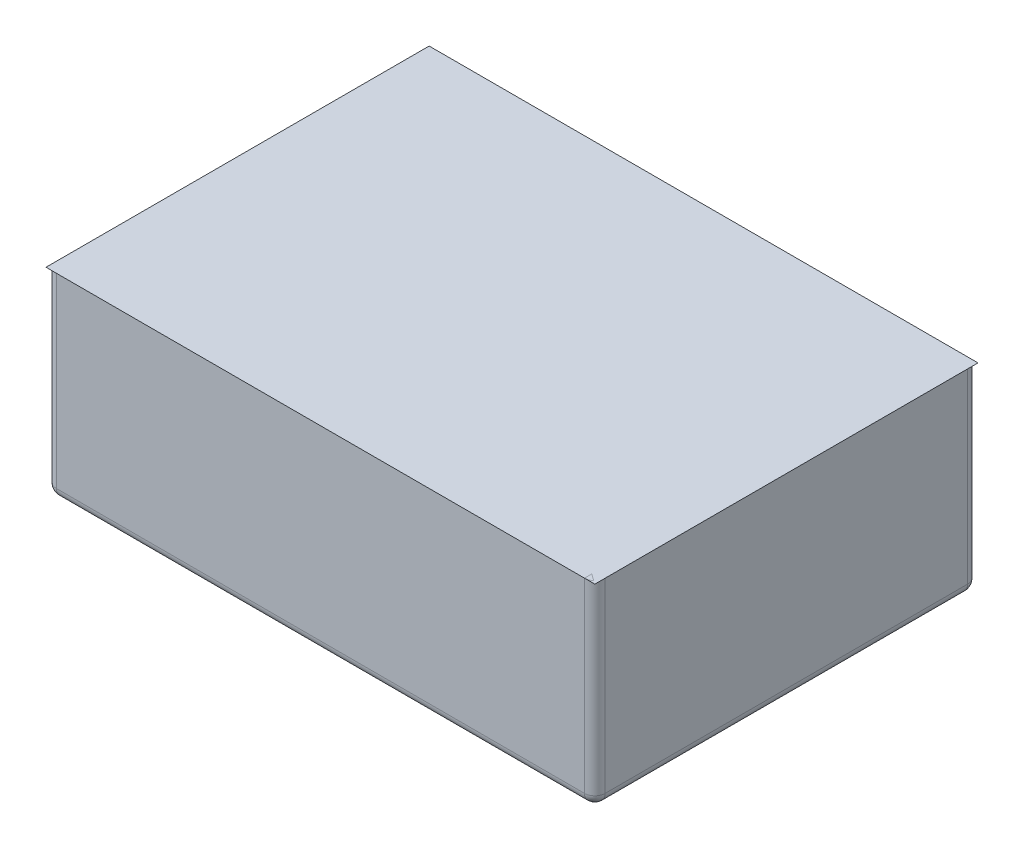
ISO-10303-21;
HEADER;
FILE_DESCRIPTION(('STEP AP214'),'2;1');
FILE_NAME('part.step','',(''),(''),'','','');
FILE_SCHEMA(('AUTOMOTIVE_DESIGN { 1 0 10303 214 1 1 1 1 }'));
ENDSEC;
DATA;
#1=APPLICATION_CONTEXT('core data for automotive mechanical design processes');
#2=APPLICATION_PROTOCOL_DEFINITION('international standard','automotive_design',2000,#1);
#3=PRODUCT_CONTEXT('',#1,'mechanical');
#4=PRODUCT('Part','Part','',(#3));
#5=PRODUCT_RELATED_PRODUCT_CATEGORY('part','',(#4));
#6=PRODUCT_DEFINITION_FORMATION('','',#4);
#7=PRODUCT_DEFINITION_CONTEXT('part definition',#1,'design');
#8=PRODUCT_DEFINITION('design','',#6,#7);
#9=PRODUCT_DEFINITION_SHAPE('','',#8);
#10=(LENGTH_UNIT() NAMED_UNIT(*) SI_UNIT(.MILLI.,.METRE.));
#11=(NAMED_UNIT(*) PLANE_ANGLE_UNIT() SI_UNIT($,.RADIAN.));
#12=(NAMED_UNIT(*) SI_UNIT($,.STERADIAN.) SOLID_ANGLE_UNIT());
#13=UNCERTAINTY_MEASURE_WITH_UNIT(LENGTH_MEASURE(1.E-05),#10,'distance_accuracy_value','');
#14=(GEOMETRIC_REPRESENTATION_CONTEXT(3) GLOBAL_UNCERTAINTY_ASSIGNED_CONTEXT((#13)) GLOBAL_UNIT_ASSIGNED_CONTEXT((#10,
#11,#12)) REPRESENTATION_CONTEXT('',''));
#15=CARTESIAN_POINT('',(0.,0.,0.));
#16=DIRECTION('',(0.,0.,1.));
#17=DIRECTION('',(1.,0.,0.));
#18=AXIS2_PLACEMENT_3D('',#15,#16,#17);
#19=CARTESIAN_POINT('',(0.,95.,0.));
#20=DIRECTION('',(0.,1.,0.));
#21=DIRECTION('',(0.,0.,1.));
#22=AXIS2_PLACEMENT_3D('',#19,#20,#21);
#23=PLANE('',#22);
#24=DIRECTION('',(1.,0.,0.));
#25=VECTOR('',#24,1.);
#26=CARTESIAN_POINT('',(-132.5,95.,92.5));
#27=LINE('',#26,#25);
#28=CARTESIAN_POINT('',(-132.5,95.,92.5));
#29=VERTEX_POINT('',#28);
#30=CARTESIAN_POINT('',(132.5,95.,92.5));
#31=VERTEX_POINT('',#30);
#32=EDGE_CURVE('E59',#29,#31,#27,.T.);
#33=ORIENTED_EDGE('',*,*,#32,.T.);
#34=DIRECTION('',(0.,0.,-1.));
#35=VECTOR('',#34,1.);
#36=CARTESIAN_POINT('',(132.5,95.,92.5));
#37=LINE('',#36,#35);
#38=CARTESIAN_POINT('',(132.5,95.,-92.5));
#39=VERTEX_POINT('',#38);
#40=EDGE_CURVE('E70',#31,#39,#37,.T.);
#41=ORIENTED_EDGE('',*,*,#40,.T.);
#42=DIRECTION('',(-1.,0.,0.));
#43=VECTOR('',#42,1.);
#44=CARTESIAN_POINT('',(132.5,95.,-92.5));
#45=LINE('',#44,#43);
#46=CARTESIAN_POINT('',(-132.5,95.,-92.5));
#47=VERTEX_POINT('',#46);
#48=EDGE_CURVE('E55',#39,#47,#45,.T.);
#49=ORIENTED_EDGE('',*,*,#48,.T.);
#50=DIRECTION('',(0.,0.,1.));
#51=VECTOR('',#50,1.);
#52=CARTESIAN_POINT('',(-132.5,95.,-92.5));
#53=LINE('',#52,#51);
#54=EDGE_CURVE('E12',#47,#29,#53,.T.);
#55=ORIENTED_EDGE('',*,*,#54,.T.);
#56=EDGE_LOOP('',(#33,#41,#49,#55));
#57=FACE_BOUND('',#56,.T.);
#58=ADVANCED_FACE('F50',(#57),#23,.T.);
#59=OPEN_SHELL('',(#58));
#60=SHELL_BASED_SURFACE_MODEL('B2',(#59));
#61=CARTESIAN_POINT('',(132.5,95.,92.5));
#62=DIRECTION('',(-1.,0.,0.));
#63=DIRECTION('',(0.,0.,1.));
#64=AXIS2_PLACEMENT_3D('',#61,#62,#63);
#65=PLANE('',#64);
#66=DIRECTION('',(0.,0.,-1.));
#67=VECTOR('',#66,1.);
#68=CARTESIAN_POINT('',(132.5,95.,92.5));
#69=LINE('',#68,#67);
#70=CARTESIAN_POINT('',(132.5,95.,87.5));
#71=VERTEX_POINT('',#70);
#72=CARTESIAN_POINT('',(132.5,95.,-87.5));
#73=VERTEX_POINT('',#72);
#74=EDGE_CURVE('E237',#71,#73,#69,.T.);
#75=ORIENTED_EDGE('',*,*,#74,.F.);
#76=DIRECTION('',(0.,-1.,0.));
#77=VECTOR('',#76,1.);
#78=CARTESIAN_POINT('',(132.5,95.,87.5));
#79=LINE('',#78,#77);
#80=CARTESIAN_POINT('',(132.5,5.,87.5));
#81=VERTEX_POINT('',#80);
#82=EDGE_CURVE('E272',#71,#81,#79,.T.);
#83=ORIENTED_EDGE('',*,*,#82,.T.);
#84=DIRECTION('',(0.,0.,-1.));
#85=VECTOR('',#84,1.);
#86=CARTESIAN_POINT('',(132.5,5.,-92.5));
#87=LINE('',#86,#85);
#88=CARTESIAN_POINT('',(132.5,5.,-87.5));
#89=VERTEX_POINT('',#88);
#90=EDGE_CURVE('E270',#81,#89,#87,.T.);
#91=ORIENTED_EDGE('',*,*,#90,.T.);
#92=DIRECTION('',(0.,-1.,0.));
#93=VECTOR('',#92,1.);
#94=CARTESIAN_POINT('',(132.5,95.,-87.5));
#95=LINE('',#94,#93);
#96=EDGE_CURVE('E268',#89,#73,#95,.F.);
#97=ORIENTED_EDGE('',*,*,#96,.T.);
#98=EDGE_LOOP('',(#75,#83,#91,#97));
#99=FACE_BOUND('',#98,.T.);
#100=ADVANCED_FACE('F94',(#99),#65,.F.);
#101=CARTESIAN_POINT('',(-132.5,95.,-92.5));
#102=DIRECTION('',(0.,0.,1.));
#103=DIRECTION('',(1.,0.,0.));
#104=AXIS2_PLACEMENT_3D('',#101,#102,#103);
#105=PLANE('',#104);
#106=DIRECTION('',(-1.,0.,0.));
#107=VECTOR('',#106,1.);
#108=CARTESIAN_POINT('',(-132.5,5.,-92.5));
#109=LINE('',#108,#107);
#110=CARTESIAN_POINT('',(127.5,5.,-92.5));
#111=VERTEX_POINT('',#110);
#112=CARTESIAN_POINT('',(-127.5,5.,-92.5));
#113=VERTEX_POINT('',#112);
#114=EDGE_CURVE('E254',#111,#113,#109,.T.);
#115=ORIENTED_EDGE('',*,*,#114,.T.);
#116=DIRECTION('',(0.,-1.,0.));
#117=VECTOR('',#116,1.);
#118=CARTESIAN_POINT('',(-127.5,95.,-92.5));
#119=LINE('',#118,#117);
#120=CARTESIAN_POINT('',(-127.5,95.,-92.5));
#121=VERTEX_POINT('',#120);
#122=EDGE_CURVE('E257',#113,#121,#119,.F.);
#123=ORIENTED_EDGE('',*,*,#122,.T.);
#124=DIRECTION('',(-1.,0.,0.));
#125=VECTOR('',#124,1.);
#126=CARTESIAN_POINT('',(-132.5,95.,-92.5));
#127=LINE('',#126,#125);
#128=CARTESIAN_POINT('',(127.5,95.,-92.5));
#129=VERTEX_POINT('',#128);
#130=EDGE_CURVE('E243',#129,#121,#127,.T.);
#131=ORIENTED_EDGE('',*,*,#130,.F.);
#132=DIRECTION('',(0.,-1.,0.));
#133=VECTOR('',#132,1.);
#134=CARTESIAN_POINT('',(127.5,95.,-92.5));
#135=LINE('',#134,#133);
#136=EDGE_CURVE('E252',#129,#111,#135,.T.);
#137=ORIENTED_EDGE('',*,*,#136,.T.);
#138=EDGE_LOOP('',(#115,#123,#131,#137));
#139=FACE_BOUND('',#138,.T.);
#140=ADVANCED_FACE('F356',(#139),#105,.F.);
#141=CARTESIAN_POINT('',(-132.5,95.,92.5));
#142=DIRECTION('',(1.,0.,0.));
#143=DIRECTION('',(0.,0.,-1.));
#144=AXIS2_PLACEMENT_3D('',#141,#142,#143);
#145=PLANE('',#144);
#146=DIRECTION('',(0.,0.,1.));
#147=VECTOR('',#146,1.);
#148=CARTESIAN_POINT('',(-132.5,5.,92.5));
#149=LINE('',#148,#147);
#150=CARTESIAN_POINT('',(-132.5,5.,-87.5));
#151=VERTEX_POINT('',#150);
#152=CARTESIAN_POINT('',(-132.5,5.,87.5));
#153=VERTEX_POINT('',#152);
#154=EDGE_CURVE('E111',#151,#153,#149,.T.);
#155=ORIENTED_EDGE('',*,*,#154,.T.);
#156=DIRECTION('',(0.,-1.,0.));
#157=VECTOR('',#156,1.);
#158=CARTESIAN_POINT('',(-132.5,95.,87.5));
#159=LINE('',#158,#157);
#160=CARTESIAN_POINT('',(-132.5,95.,87.5));
#161=VERTEX_POINT('',#160);
#162=EDGE_CURVE('E282',#153,#161,#159,.F.);
#163=ORIENTED_EDGE('',*,*,#162,.T.);
#164=DIRECTION('',(0.,0.,1.));
#165=VECTOR('',#164,1.);
#166=CARTESIAN_POINT('',(-132.5,95.,92.5));
#167=LINE('',#166,#165);
#168=CARTESIAN_POINT('',(-132.5,95.,-87.5));
#169=VERTEX_POINT('',#168);
#170=EDGE_CURVE('E246',#169,#161,#167,.T.);
#171=ORIENTED_EDGE('',*,*,#170,.F.);
#172=DIRECTION('',(0.,-1.,0.));
#173=VECTOR('',#172,1.);
#174=CARTESIAN_POINT('',(-132.5,95.,-87.5));
#175=LINE('',#174,#173);
#176=EDGE_CURVE('E116',#169,#151,#175,.T.);
#177=ORIENTED_EDGE('',*,*,#176,.T.);
#178=EDGE_LOOP('',(#155,#163,#171,#177));
#179=FACE_BOUND('',#178,.T.);
#180=ADVANCED_FACE('F363',(#179),#145,.F.);
#181=CARTESIAN_POINT('',(-132.5,95.,92.5));
#182=DIRECTION('',(0.,0.,-1.));
#183=DIRECTION('',(-1.,0.,0.));
#184=AXIS2_PLACEMENT_3D('',#181,#182,#183);
#185=PLANE('',#184);
#186=DIRECTION('',(1.,0.,0.));
#187=VECTOR('',#186,1.);
#188=CARTESIAN_POINT('',(-132.5,95.,92.5));
#189=LINE('',#188,#187);
#190=CARTESIAN_POINT('',(-127.5,95.,92.5));
#191=VERTEX_POINT('',#190);
#192=CARTESIAN_POINT('',(127.5,95.,92.5));
#193=VERTEX_POINT('',#192);
#194=EDGE_CURVE('E249',#191,#193,#189,.T.);
#195=ORIENTED_EDGE('',*,*,#194,.F.);
#196=DIRECTION('',(0.,-1.,0.));
#197=VECTOR('',#196,1.);
#198=CARTESIAN_POINT('',(-127.5,95.,92.5));
#199=LINE('',#198,#197);
#200=CARTESIAN_POINT('',(-127.5,5.,92.5));
#201=VERTEX_POINT('',#200);
#202=EDGE_CURVE('E278',#191,#201,#199,.T.);
#203=ORIENTED_EDGE('',*,*,#202,.T.);
#204=DIRECTION('',(1.,0.,0.));
#205=VECTOR('',#204,1.);
#206=CARTESIAN_POINT('',(132.5,5.,92.5));
#207=LINE('',#206,#205);
#208=CARTESIAN_POINT('',(127.5,5.,92.5));
#209=VERTEX_POINT('',#208);
#210=EDGE_CURVE('E276',#201,#209,#207,.T.);
#211=ORIENTED_EDGE('',*,*,#210,.T.);
#212=DIRECTION('',(0.,-1.,0.));
#213=VECTOR('',#212,1.);
#214=CARTESIAN_POINT('',(127.5,95.,92.5));
#215=LINE('',#214,#213);
#216=EDGE_CURVE('E274',#209,#193,#215,.F.);
#217=ORIENTED_EDGE('',*,*,#216,.T.);
#218=EDGE_LOOP('',(#195,#203,#211,#217));
#219=FACE_BOUND('',#218,.T.);
#220=ADVANCED_FACE('F422',(#219),#185,.F.);
#221=CARTESIAN_POINT('',(0.,95.,0.));
#222=DIRECTION('',(0.,-1.,0.));
#223=DIRECTION('',(0.,0.,-1.));
#224=AXIS2_PLACEMENT_3D('',#221,#222,#223);
#225=PLANE('',#224);
#226=DIRECTION('',(-1.,0.,0.));
#227=VECTOR('',#226,1.);
#228=CARTESIAN_POINT('',(-127.5,95.,-87.5));
#229=LINE('',#228,#227);
#230=CARTESIAN_POINT('',(127.5,95.,-87.5));
#231=VERTEX_POINT('',#230);
#232=CARTESIAN_POINT('',(-127.5,95.,-87.5));
#233=VERTEX_POINT('',#232);
#234=EDGE_CURVE('E231',#231,#233,#229,.T.);
#235=ORIENTED_EDGE('',*,*,#234,.F.);
#236=DIRECTION('',(0.,0.,-1.));
#237=VECTOR('',#236,1.);
#238=CARTESIAN_POINT('',(127.5,95.,87.5));
#239=LINE('',#238,#237);
#240=CARTESIAN_POINT('',(127.5,95.,87.5));
#241=VERTEX_POINT('',#240);
#242=EDGE_CURVE('E202',#241,#231,#239,.T.);
#243=ORIENTED_EDGE('',*,*,#242,.F.);
#244=DIRECTION('',(1.,0.,0.));
#245=VECTOR('',#244,1.);
#246=CARTESIAN_POINT('',(-127.5,95.,87.5));
#247=LINE('',#246,#245);
#248=CARTESIAN_POINT('',(-127.5,95.,87.5));
#249=VERTEX_POINT('',#248);
#250=EDGE_CURVE('E219',#249,#241,#247,.T.);
#251=ORIENTED_EDGE('',*,*,#250,.F.);
#252=DIRECTION('',(0.,0.,1.));
#253=VECTOR('',#252,1.);
#254=CARTESIAN_POINT('',(-127.5,95.,87.5));
#255=LINE('',#254,#253);
#256=EDGE_CURVE('E222',#233,#249,#255,.T.);
#257=ORIENTED_EDGE('',*,*,#256,.F.);
#258=EDGE_LOOP('',(#235,#243,#251,#257));
#259=FACE_BOUND('',#258,.T.);
#260=ORIENTED_EDGE('',*,*,#170,.T.);
#261=CARTESIAN_POINT('',(-127.5,95.,87.5));
#262=DIRECTION('',(0.,-1.,0.));
#263=DIRECTION('',(0.,0.,-1.));
#264=AXIS2_PLACEMENT_3D('',#261,#262,#263);
#265=CIRCLE('',#264,5.);
#266=EDGE_CURVE('E48',#161,#191,#265,.F.);
#267=ORIENTED_EDGE('',*,*,#266,.T.);
#268=ORIENTED_EDGE('',*,*,#194,.T.);
#269=CARTESIAN_POINT('',(127.5,95.,87.5));
#270=DIRECTION('',(0.,-1.,0.));
#271=DIRECTION('',(0.,0.,-1.));
#272=AXIS2_PLACEMENT_3D('',#269,#270,#271);
#273=CIRCLE('',#272,5.);
#274=EDGE_CURVE('E286',#193,#71,#273,.F.);
#275=ORIENTED_EDGE('',*,*,#274,.T.);
#276=ORIENTED_EDGE('',*,*,#74,.T.);
#277=CARTESIAN_POINT('',(127.5,95.,-87.5));
#278=DIRECTION('',(0.,-1.,0.));
#279=DIRECTION('',(0.,0.,-1.));
#280=AXIS2_PLACEMENT_3D('',#277,#278,#279);
#281=CIRCLE('',#280,5.);
#282=EDGE_CURVE('E284',#73,#129,#281,.F.);
#283=ORIENTED_EDGE('',*,*,#282,.T.);
#284=ORIENTED_EDGE('',*,*,#130,.T.);
#285=CARTESIAN_POINT('',(-127.5,95.,-87.5));
#286=DIRECTION('',(0.,-1.,0.));
#287=DIRECTION('',(0.,0.,-1.));
#288=AXIS2_PLACEMENT_3D('',#285,#286,#287);
#289=CIRCLE('',#288,5.);
#290=EDGE_CURVE('E103',#121,#169,#289,.F.);
#291=ORIENTED_EDGE('',*,*,#290,.T.);
#292=EDGE_LOOP('',(#260,#267,#268,#275,#276,#283,#284,#291));
#293=FACE_BOUND('',#292,.T.);
#294=ADVANCED_FACE('F419',(#259,#293),#225,.F.);
#295=CARTESIAN_POINT('',(0.,0.,0.));
#296=DIRECTION('',(0.,-1.,0.));
#297=DIRECTION('',(0.,0.,-1.));
#298=AXIS2_PLACEMENT_3D('',#295,#296,#297);
#299=PLANE('',#298);
#300=DIRECTION('',(0.,0.,1.));
#301=VECTOR('',#300,1.);
#302=CARTESIAN_POINT('',(-127.5,0.,-92.5));
#303=LINE('',#302,#301);
#304=CARTESIAN_POINT('',(-127.5,0.,87.5));
#305=VERTEX_POINT('',#304);
#306=CARTESIAN_POINT('',(-127.5,0.,-87.5));
#307=VERTEX_POINT('',#306);
#308=EDGE_CURVE('E259',#305,#307,#303,.F.);
#309=ORIENTED_EDGE('',*,*,#308,.T.);
#310=DIRECTION('',(-1.,0.,0.));
#311=VECTOR('',#310,1.);
#312=CARTESIAN_POINT('',(132.5,0.,-87.5));
#313=LINE('',#312,#311);
#314=CARTESIAN_POINT('',(127.5,0.,-87.5));
#315=VERTEX_POINT('',#314);
#316=EDGE_CURVE('E265',#307,#315,#313,.F.);
#317=ORIENTED_EDGE('',*,*,#316,.T.);
#318=DIRECTION('',(0.,0.,-1.));
#319=VECTOR('',#318,1.);
#320=CARTESIAN_POINT('',(127.5,0.,92.5));
#321=LINE('',#320,#319);
#322=CARTESIAN_POINT('',(127.5,0.,87.5));
#323=VERTEX_POINT('',#322);
#324=EDGE_CURVE('E263',#315,#323,#321,.F.);
#325=ORIENTED_EDGE('',*,*,#324,.T.);
#326=DIRECTION('',(1.,0.,0.));
#327=VECTOR('',#326,1.);
#328=CARTESIAN_POINT('',(-132.5,0.,87.5));
#329=LINE('',#328,#327);
#330=EDGE_CURVE('E261',#323,#305,#329,.F.);
#331=ORIENTED_EDGE('',*,*,#330,.T.);
#332=EDGE_LOOP('',(#309,#317,#325,#331));
#333=FACE_BOUND('',#332,.T.);
#334=CARTESIAN_POINT('',(0.,0.,-55.));
#335=DIRECTION('',(0.,-1.,0.));
#336=DIRECTION('',(0.,0.,-1.));
#337=AXIS2_PLACEMENT_3D('',#334,#335,#336);
#338=CIRCLE('',#337,8.89);
#339=CARTESIAN_POINT('',(0.,0.,-63.89));
#340=VERTEX_POINT('',#339);
#341=EDGE_CURVE('E322',#340,#340,#338,.T.);
#342=ORIENTED_EDGE('',*,*,#341,.F.);
#343=EDGE_LOOP('',(#342));
#344=FACE_BOUND('',#343,.T.);
#345=CARTESIAN_POINT('',(0.,0.,55.));
#346=DIRECTION('',(0.,-1.,0.));
#347=DIRECTION('',(0.,0.,-1.));
#348=AXIS2_PLACEMENT_3D('',#345,#346,#347);
#349=CIRCLE('',#348,8.89);
#350=CARTESIAN_POINT('',(0.,0.,46.11));
#351=VERTEX_POINT('',#350);
#352=EDGE_CURVE('E330',#351,#351,#349,.T.);
#353=ORIENTED_EDGE('',*,*,#352,.F.);
#354=EDGE_LOOP('',(#353));
#355=FACE_BOUND('',#354,.T.);
#356=ADVANCED_FACE('F430',(#333,#344,#355),#299,.T.);
#357=CARTESIAN_POINT('',(127.5,9.99999999999999,87.5));
#358=DIRECTION('',(1.,0.,0.));
#359=DIRECTION('',(0.,0.,-1.));
#360=AXIS2_PLACEMENT_3D('',#357,#358,#359);
#361=PLANE('',#360);
#362=ORIENTED_EDGE('',*,*,#242,.T.);
#363=DIRECTION('',(0.,1.,0.));
#364=VECTOR('',#363,1.);
#365=CARTESIAN_POINT('',(127.5,9.99999999999999,-87.5));
#366=LINE('',#365,#364);
#367=CARTESIAN_POINT('',(127.5,9.99999999999999,-87.5));
#368=VERTEX_POINT('',#367);
#369=EDGE_CURVE('E195',#368,#231,#366,.T.);
#370=ORIENTED_EDGE('',*,*,#369,.F.);
#371=DIRECTION('',(0.,0.,-1.));
#372=VECTOR('',#371,1.);
#373=CARTESIAN_POINT('',(127.5,9.99999999999999,87.5));
#374=LINE('',#373,#372);
#375=CARTESIAN_POINT('',(127.5,9.99999999999999,87.5));
#376=VERTEX_POINT('',#375);
#377=EDGE_CURVE('E199',#376,#368,#374,.T.);
#378=ORIENTED_EDGE('',*,*,#377,.F.);
#379=DIRECTION('',(0.,1.,0.));
#380=VECTOR('',#379,1.);
#381=CARTESIAN_POINT('',(127.5,9.99999999999999,87.5));
#382=LINE('',#381,#380);
#383=EDGE_CURVE('E235',#376,#241,#382,.T.);
#384=ORIENTED_EDGE('',*,*,#383,.T.);
#385=EDGE_LOOP('',(#362,#370,#378,#384));
#386=FACE_BOUND('',#385,.T.);
#387=ADVANCED_FACE('F197',(#386),#361,.F.);
#388=CARTESIAN_POINT('',(-127.5,9.99999999999999,87.5));
#389=DIRECTION('',(0.,0.,1.));
#390=DIRECTION('',(1.,0.,0.));
#391=AXIS2_PLACEMENT_3D('',#388,#389,#390);
#392=PLANE('',#391);
#393=ORIENTED_EDGE('',*,*,#250,.T.);
#394=ORIENTED_EDGE('',*,*,#383,.F.);
#395=DIRECTION('',(1.,0.,0.));
#396=VECTOR('',#395,1.);
#397=CARTESIAN_POINT('',(-127.5,9.99999999999999,87.5));
#398=LINE('',#397,#396);
#399=CARTESIAN_POINT('',(-127.5,9.99999999999999,87.5));
#400=VERTEX_POINT('',#399);
#401=EDGE_CURVE('E207',#400,#376,#398,.T.);
#402=ORIENTED_EDGE('',*,*,#401,.F.);
#403=DIRECTION('',(0.,1.,0.));
#404=VECTOR('',#403,1.);
#405=CARTESIAN_POINT('',(-127.5,9.99999999999999,87.5));
#406=LINE('',#405,#404);
#407=EDGE_CURVE('E238',#400,#249,#406,.T.);
#408=ORIENTED_EDGE('',*,*,#407,.T.);
#409=EDGE_LOOP('',(#393,#394,#402,#408));
#410=FACE_BOUND('',#409,.T.);
#411=ADVANCED_FACE('F460',(#410),#392,.F.);
#412=CARTESIAN_POINT('',(-127.5,9.99999999999999,87.5));
#413=DIRECTION('',(-1.,0.,0.));
#414=DIRECTION('',(0.,0.,1.));
#415=AXIS2_PLACEMENT_3D('',#412,#413,#414);
#416=PLANE('',#415);
#417=ORIENTED_EDGE('',*,*,#256,.T.);
#418=ORIENTED_EDGE('',*,*,#407,.F.);
#419=DIRECTION('',(0.,0.,1.));
#420=VECTOR('',#419,1.);
#421=CARTESIAN_POINT('',(-127.5,9.99999999999999,87.5));
#422=LINE('',#421,#420);
#423=CARTESIAN_POINT('',(-127.5,9.99999999999999,-87.5));
#424=VERTEX_POINT('',#423);
#425=EDGE_CURVE('E215',#424,#400,#422,.T.);
#426=ORIENTED_EDGE('',*,*,#425,.F.);
#427=DIRECTION('',(0.,1.,0.));
#428=VECTOR('',#427,1.);
#429=CARTESIAN_POINT('',(-127.5,9.99999999999999,-87.5));
#430=LINE('',#429,#428);
#431=EDGE_CURVE('E206',#424,#233,#430,.T.);
#432=ORIENTED_EDGE('',*,*,#431,.T.);
#433=EDGE_LOOP('',(#417,#418,#426,#432));
#434=FACE_BOUND('',#433,.T.);
#435=ADVANCED_FACE('F351',(#434),#416,.F.);
#436=CARTESIAN_POINT('',(-127.5,9.99999999999999,-87.5));
#437=DIRECTION('',(0.,0.,-1.));
#438=DIRECTION('',(-1.,0.,0.));
#439=AXIS2_PLACEMENT_3D('',#436,#437,#438);
#440=PLANE('',#439);
#441=ORIENTED_EDGE('',*,*,#234,.T.);
#442=ORIENTED_EDGE('',*,*,#431,.F.);
#443=DIRECTION('',(-1.,0.,0.));
#444=VECTOR('',#443,1.);
#445=CARTESIAN_POINT('',(-127.5,9.99999999999999,-87.5));
#446=LINE('',#445,#444);
#447=EDGE_CURVE('E210',#368,#424,#446,.T.);
#448=ORIENTED_EDGE('',*,*,#447,.F.);
#449=ORIENTED_EDGE('',*,*,#369,.T.);
#450=EDGE_LOOP('',(#441,#442,#448,#449));
#451=FACE_BOUND('',#450,.T.);
#452=ADVANCED_FACE('F211',(#451),#440,.F.);
#453=CARTESIAN_POINT('',(0.,9.99999999999999,0.));
#454=DIRECTION('',(0.,-1.,0.));
#455=DIRECTION('',(0.,0.,-1.));
#456=AXIS2_PLACEMENT_3D('',#453,#454,#455);
#457=PLANE('',#456);
#458=CARTESIAN_POINT('',(0.,9.99999999999999,-55.));
#459=DIRECTION('',(0.,-1.,0.));
#460=DIRECTION('',(0.,0.,-1.));
#461=AXIS2_PLACEMENT_3D('',#458,#459,#460);
#462=CIRCLE('',#461,8.89);
#463=CARTESIAN_POINT('',(0.,9.99999999999999,-63.89));
#464=VERTEX_POINT('',#463);
#465=EDGE_CURVE('E325',#464,#464,#462,.F.);
#466=ORIENTED_EDGE('',*,*,#465,.F.);
#467=EDGE_LOOP('',(#466));
#468=FACE_BOUND('',#467,.T.);
#469=CARTESIAN_POINT('',(0.,9.99999999999999,55.));
#470=DIRECTION('',(0.,-1.,0.));
#471=DIRECTION('',(0.,0.,-1.));
#472=AXIS2_PLACEMENT_3D('',#469,#470,#471);
#473=CIRCLE('',#472,8.89);
#474=CARTESIAN_POINT('',(0.,9.99999999999999,46.11));
#475=VERTEX_POINT('',#474);
#476=EDGE_CURVE('E225',#475,#475,#473,.F.);
#477=ORIENTED_EDGE('',*,*,#476,.F.);
#478=EDGE_LOOP('',(#477));
#479=FACE_BOUND('',#478,.T.);
#480=ORIENTED_EDGE('',*,*,#377,.T.);
#481=ORIENTED_EDGE('',*,*,#447,.T.);
#482=ORIENTED_EDGE('',*,*,#425,.T.);
#483=ORIENTED_EDGE('',*,*,#401,.T.);
#484=EDGE_LOOP('',(#480,#481,#482,#483));
#485=FACE_BOUND('',#484,.T.);
#486=ADVANCED_FACE('F217',(#468,#479,#485),#457,.F.);
#487=CARTESIAN_POINT('',(0.,95.001,55.));
#488=DIRECTION('',(0.,-1.,0.));
#489=DIRECTION('',(0.,0.,-1.));
#490=AXIS2_PLACEMENT_3D('',#487,#488,#489);
#491=CYLINDRICAL_SURFACE('',#490,8.89);
#492=ORIENTED_EDGE('',*,*,#352,.T.);
#493=EDGE_LOOP('',(#492));
#494=FACE_BOUND('',#493,.T.);
#495=ORIENTED_EDGE('',*,*,#476,.T.);
#496=EDGE_LOOP('',(#495));
#497=FACE_BOUND('',#496,.T.);
#498=ADVANCED_FACE('F338',(#494,#497),#491,.F.);
#499=CARTESIAN_POINT('',(0.,95.001,-55.));
#500=DIRECTION('',(0.,-1.,0.));
#501=DIRECTION('',(0.,0.,-1.));
#502=AXIS2_PLACEMENT_3D('',#499,#500,#501);
#503=CYLINDRICAL_SURFACE('',#502,8.89);
#504=ORIENTED_EDGE('',*,*,#341,.T.);
#505=EDGE_LOOP('',(#504));
#506=FACE_BOUND('',#505,.T.);
#507=ORIENTED_EDGE('',*,*,#465,.T.);
#508=EDGE_LOOP('',(#507));
#509=FACE_BOUND('',#508,.T.);
#510=ADVANCED_FACE('F348',(#506,#509),#503,.F.);
#511=CARTESIAN_POINT('',(127.5,95.,87.5));
#512=DIRECTION('',(0.,-1.,0.));
#513=DIRECTION('',(0.,0.,-1.));
#514=AXIS2_PLACEMENT_3D('',#511,#512,#513);
#515=CYLINDRICAL_SURFACE('',#514,5.);
#516=ORIENTED_EDGE('',*,*,#274,.F.);
#517=ORIENTED_EDGE('',*,*,#216,.F.);
#518=CARTESIAN_POINT('',(127.5,5.,87.5));
#519=DIRECTION('',(0.,-1.,0.));
#520=DIRECTION('',(0.,0.,-1.));
#521=AXIS2_PLACEMENT_3D('',#518,#519,#520);
#522=CIRCLE('',#521,5.);
#523=EDGE_CURVE('E316',#81,#209,#522,.T.);
#524=ORIENTED_EDGE('',*,*,#523,.F.);
#525=ORIENTED_EDGE('',*,*,#82,.F.);
#526=EDGE_LOOP('',(#516,#517,#524,#525));
#527=FACE_BOUND('',#526,.T.);
#528=ADVANCED_FACE('F96',(#527),#515,.T.);
#529=CARTESIAN_POINT('',(-127.5,95.,87.5));
#530=DIRECTION('',(0.,-1.,0.));
#531=DIRECTION('',(0.,0.,-1.));
#532=AXIS2_PLACEMENT_3D('',#529,#530,#531);
#533=CYLINDRICAL_SURFACE('',#532,5.);
#534=ORIENTED_EDGE('',*,*,#266,.F.);
#535=ORIENTED_EDGE('',*,*,#162,.F.);
#536=CARTESIAN_POINT('',(-127.5,5.,87.5));
#537=DIRECTION('',(0.,-1.,0.));
#538=DIRECTION('',(0.,0.,-1.));
#539=AXIS2_PLACEMENT_3D('',#536,#537,#538);
#540=CIRCLE('',#539,5.);
#541=EDGE_CURVE('E314',#201,#153,#540,.T.);
#542=ORIENTED_EDGE('',*,*,#541,.F.);
#543=ORIENTED_EDGE('',*,*,#202,.F.);
#544=EDGE_LOOP('',(#534,#535,#542,#543));
#545=FACE_BOUND('',#544,.T.);
#546=ADVANCED_FACE('F406',(#545),#533,.T.);
#547=CARTESIAN_POINT('',(-132.5,5.,87.5));
#548=DIRECTION('',(-1.,0.,0.));
#549=DIRECTION('',(0.,0.,1.));
#550=AXIS2_PLACEMENT_3D('',#547,#548,#549);
#551=CYLINDRICAL_SURFACE('',#550,5.);
#552=CARTESIAN_POINT('',(127.5,5.,87.5));
#553=DIRECTION('',(1.,0.,0.));
#554=DIRECTION('',(0.,0.,-1.));
#555=AXIS2_PLACEMENT_3D('',#552,#553,#554);
#556=CIRCLE('',#555,5.);
#557=EDGE_CURVE('E98',#209,#323,#556,.T.);
#558=ORIENTED_EDGE('',*,*,#557,.F.);
#559=ORIENTED_EDGE('',*,*,#210,.F.);
#560=CARTESIAN_POINT('',(-127.5,5.,87.5));
#561=DIRECTION('',(-1.,0.,0.));
#562=DIRECTION('',(0.,0.,1.));
#563=AXIS2_PLACEMENT_3D('',#560,#561,#562);
#564=CIRCLE('',#563,5.);
#565=EDGE_CURVE('E311',#305,#201,#564,.T.);
#566=ORIENTED_EDGE('',*,*,#565,.F.);
#567=ORIENTED_EDGE('',*,*,#330,.F.);
#568=EDGE_LOOP('',(#558,#559,#566,#567));
#569=FACE_BOUND('',#568,.T.);
#570=ADVANCED_FACE('F404',(#569),#551,.T.);
#571=CARTESIAN_POINT('',(127.5,5.,87.5));
#572=DIRECTION('',(0.,0.,1.));
#573=DIRECTION('',(1.,0.,0.));
#574=AXIS2_PLACEMENT_3D('',#571,#572,#573);
#575=SPHERICAL_SURFACE('',#574,5.);
#576=ORIENTED_EDGE('',*,*,#523,.T.);
#577=ORIENTED_EDGE('',*,*,#557,.T.);
#578=CARTESIAN_POINT('',(127.5,5.,87.5));
#579=DIRECTION('',(0.,0.,1.));
#580=DIRECTION('',(1.,0.,0.));
#581=AXIS2_PLACEMENT_3D('',#578,#579,#580);
#582=CIRCLE('',#581,5.);
#583=EDGE_CURVE('E308',#81,#323,#582,.F.);
#584=ORIENTED_EDGE('',*,*,#583,.F.);
#585=EDGE_LOOP('',(#576,#577,#584));
#586=FACE_BOUND('',#585,.T.);
#587=ADVANCED_FACE('F400',(#586),#575,.T.);
#588=CARTESIAN_POINT('',(-127.5,5.,87.5));
#589=DIRECTION('',(0.,0.,1.));
#590=DIRECTION('',(1.,0.,0.));
#591=AXIS2_PLACEMENT_3D('',#588,#589,#590);
#592=SPHERICAL_SURFACE('',#591,5.);
#593=ORIENTED_EDGE('',*,*,#565,.T.);
#594=ORIENTED_EDGE('',*,*,#541,.T.);
#595=CARTESIAN_POINT('',(-127.5,5.,87.5));
#596=DIRECTION('',(0.,0.,1.));
#597=DIRECTION('',(1.,0.,0.));
#598=AXIS2_PLACEMENT_3D('',#595,#596,#597);
#599=CIRCLE('',#598,5.);
#600=EDGE_CURVE('E305',#305,#153,#599,.F.);
#601=ORIENTED_EDGE('',*,*,#600,.F.);
#602=EDGE_LOOP('',(#593,#594,#601));
#603=FACE_BOUND('',#602,.T.);
#604=ADVANCED_FACE('F396',(#603),#592,.T.);
#605=CARTESIAN_POINT('',(127.5,5.,92.5));
#606=DIRECTION('',(0.,0.,1.));
#607=DIRECTION('',(1.,0.,0.));
#608=AXIS2_PLACEMENT_3D('',#605,#606,#607);
#609=CYLINDRICAL_SURFACE('',#608,5.);
#610=ORIENTED_EDGE('',*,*,#583,.T.);
#611=ORIENTED_EDGE('',*,*,#324,.F.);
#612=CARTESIAN_POINT('',(127.5,5.,-87.5));
#613=DIRECTION('',(0.,0.,-1.));
#614=DIRECTION('',(-1.,0.,0.));
#615=AXIS2_PLACEMENT_3D('',#612,#613,#614);
#616=CIRCLE('',#615,5.);
#617=EDGE_CURVE('E302',#89,#315,#616,.T.);
#618=ORIENTED_EDGE('',*,*,#617,.F.);
#619=ORIENTED_EDGE('',*,*,#90,.F.);
#620=EDGE_LOOP('',(#610,#611,#618,#619));
#621=FACE_BOUND('',#620,.T.);
#622=ADVANCED_FACE('F392',(#621),#609,.T.);
#623=CARTESIAN_POINT('',(127.5,95.,-87.5));
#624=DIRECTION('',(0.,-1.,0.));
#625=DIRECTION('',(0.,0.,-1.));
#626=AXIS2_PLACEMENT_3D('',#623,#624,#625);
#627=CYLINDRICAL_SURFACE('',#626,5.);
#628=ORIENTED_EDGE('',*,*,#282,.F.);
#629=ORIENTED_EDGE('',*,*,#96,.F.);
#630=CARTESIAN_POINT('',(127.5,5.,-87.5));
#631=DIRECTION('',(0.,-1.,0.));
#632=DIRECTION('',(0.,0.,-1.));
#633=AXIS2_PLACEMENT_3D('',#630,#631,#632);
#634=CIRCLE('',#633,5.);
#635=EDGE_CURVE('E299',#111,#89,#634,.T.);
#636=ORIENTED_EDGE('',*,*,#635,.F.);
#637=ORIENTED_EDGE('',*,*,#136,.F.);
#638=EDGE_LOOP('',(#628,#629,#636,#637));
#639=FACE_BOUND('',#638,.T.);
#640=ADVANCED_FACE('F388',(#639),#627,.T.);
#641=CARTESIAN_POINT('',(-127.5,95.,-87.5));
#642=DIRECTION('',(0.,-1.,0.));
#643=DIRECTION('',(0.,0.,-1.));
#644=AXIS2_PLACEMENT_3D('',#641,#642,#643);
#645=CYLINDRICAL_SURFACE('',#644,5.);
#646=ORIENTED_EDGE('',*,*,#290,.F.);
#647=ORIENTED_EDGE('',*,*,#122,.F.);
#648=CARTESIAN_POINT('',(-127.5,5.,-87.5));
#649=DIRECTION('',(0.,-1.,0.));
#650=DIRECTION('',(0.,0.,-1.));
#651=AXIS2_PLACEMENT_3D('',#648,#649,#650);
#652=CIRCLE('',#651,5.);
#653=EDGE_CURVE('E296',#151,#113,#652,.T.);
#654=ORIENTED_EDGE('',*,*,#653,.F.);
#655=ORIENTED_EDGE('',*,*,#176,.F.);
#656=EDGE_LOOP('',(#646,#647,#654,#655));
#657=FACE_BOUND('',#656,.T.);
#658=ADVANCED_FACE('F384',(#657),#645,.T.);
#659=CARTESIAN_POINT('',(-127.5,5.,92.5));
#660=DIRECTION('',(0.,0.,-1.));
#661=DIRECTION('',(-1.,0.,0.));
#662=AXIS2_PLACEMENT_3D('',#659,#660,#661);
#663=CYLINDRICAL_SURFACE('',#662,5.);
#664=ORIENTED_EDGE('',*,*,#600,.T.);
#665=ORIENTED_EDGE('',*,*,#154,.F.);
#666=CARTESIAN_POINT('',(-127.5,5.,-87.5));
#667=DIRECTION('',(0.,0.,-1.));
#668=DIRECTION('',(-1.,0.,0.));
#669=AXIS2_PLACEMENT_3D('',#666,#667,#668);
#670=CIRCLE('',#669,5.);
#671=EDGE_CURVE('E293',#307,#151,#670,.T.);
#672=ORIENTED_EDGE('',*,*,#671,.F.);
#673=ORIENTED_EDGE('',*,*,#308,.F.);
#674=EDGE_LOOP('',(#664,#665,#672,#673));
#675=FACE_BOUND('',#674,.T.);
#676=ADVANCED_FACE('F380',(#675),#663,.T.);
#677=CARTESIAN_POINT('',(127.5,5.,-87.5));
#678=DIRECTION('',(0.,0.,1.));
#679=DIRECTION('',(1.,0.,0.));
#680=AXIS2_PLACEMENT_3D('',#677,#678,#679);
#681=SPHERICAL_SURFACE('',#680,5.);
#682=ORIENTED_EDGE('',*,*,#635,.T.);
#683=ORIENTED_EDGE('',*,*,#617,.T.);
#684=CARTESIAN_POINT('',(127.5,5.,-87.5));
#685=DIRECTION('',(1.,0.,0.));
#686=DIRECTION('',(0.,0.,-1.));
#687=AXIS2_PLACEMENT_3D('',#684,#685,#686);
#688=CIRCLE('',#687,5.);
#689=EDGE_CURVE('E291',#111,#315,#688,.F.);
#690=ORIENTED_EDGE('',*,*,#689,.F.);
#691=EDGE_LOOP('',(#682,#683,#690));
#692=FACE_BOUND('',#691,.T.);
#693=ADVANCED_FACE('F376',(#692),#681,.T.);
#694=CARTESIAN_POINT('',(-127.5,5.,-87.5));
#695=DIRECTION('',(0.,0.,1.));
#696=DIRECTION('',(1.,0.,0.));
#697=AXIS2_PLACEMENT_3D('',#694,#695,#696);
#698=SPHERICAL_SURFACE('',#697,5.);
#699=ORIENTED_EDGE('',*,*,#671,.T.);
#700=ORIENTED_EDGE('',*,*,#653,.T.);
#701=CARTESIAN_POINT('',(-127.5,5.,-87.5));
#702=DIRECTION('',(-1.,0.,0.));
#703=DIRECTION('',(0.,0.,1.));
#704=AXIS2_PLACEMENT_3D('',#701,#702,#703);
#705=CIRCLE('',#704,5.);
#706=EDGE_CURVE('E289',#307,#113,#705,.F.);
#707=ORIENTED_EDGE('',*,*,#706,.F.);
#708=EDGE_LOOP('',(#699,#700,#707));
#709=FACE_BOUND('',#708,.T.);
#710=ADVANCED_FACE('F372',(#709),#698,.T.);
#711=CARTESIAN_POINT('',(-132.5,5.,-87.5));
#712=DIRECTION('',(1.,0.,0.));
#713=DIRECTION('',(0.,0.,-1.));
#714=AXIS2_PLACEMENT_3D('',#711,#712,#713);
#715=CYLINDRICAL_SURFACE('',#714,5.);
#716=ORIENTED_EDGE('',*,*,#689,.T.);
#717=ORIENTED_EDGE('',*,*,#316,.F.);
#718=ORIENTED_EDGE('',*,*,#706,.T.);
#719=ORIENTED_EDGE('',*,*,#114,.F.);
#720=EDGE_LOOP('',(#716,#717,#718,#719));
#721=FACE_BOUND('',#720,.T.);
#722=ADVANCED_FACE('F369',(#721),#715,.T.);
#723=CLOSED_SHELL('',(#100,#140,#180,#220,#294,#356,#387,#411,#435,#452,#486,#498,#510,#528,
#546,#570,#587,#604,#622,#640,#658,#676,#693,#710,#722));
#724=MANIFOLD_SOLID_BREP('B6',#723);
#725=ADVANCED_BREP_SHAPE_REPRESENTATION('',(#18,#724),#14);
#726=MANIFOLD_SURFACE_SHAPE_REPRESENTATION('',(#18,#60),#14);
#727=SHAPE_REPRESENTATION('',(#18),#14);
#728=SHAPE_DEFINITION_REPRESENTATION(#9,#727);
#729=SHAPE_REPRESENTATION_RELATIONSHIP('','',#727,#725);
#730=SHAPE_REPRESENTATION_RELATIONSHIP('','',#727,#726);
ENDSEC;
END-ISO-10303-21;
